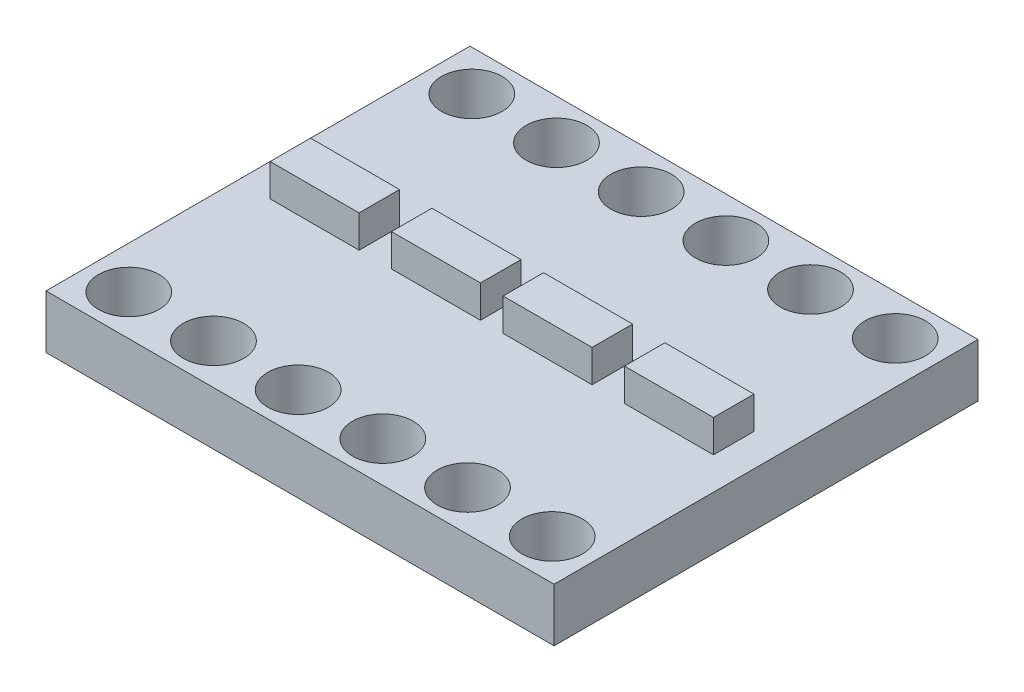
ISO-10303-21;
HEADER;
FILE_DESCRIPTION(('STEP AP214'),'2;1');
FILE_NAME('part.step','',(''),(''),'','','');
FILE_SCHEMA(('AUTOMOTIVE_DESIGN { 1 0 10303 214 1 1 1 1 }'));
ENDSEC;
DATA;
#1=APPLICATION_CONTEXT('core data for automotive mechanical design processes');
#2=APPLICATION_PROTOCOL_DEFINITION('international standard','automotive_design',2000,#1);
#3=PRODUCT_CONTEXT('',#1,'mechanical');
#4=PRODUCT('Part','Part','',(#3));
#5=PRODUCT_RELATED_PRODUCT_CATEGORY('part','',(#4));
#6=PRODUCT_DEFINITION_FORMATION('','',#4);
#7=PRODUCT_DEFINITION_CONTEXT('part definition',#1,'design');
#8=PRODUCT_DEFINITION('design','',#6,#7);
#9=PRODUCT_DEFINITION_SHAPE('','',#8);
#10=(LENGTH_UNIT() NAMED_UNIT(*) SI_UNIT(.MILLI.,.METRE.));
#11=(NAMED_UNIT(*) PLANE_ANGLE_UNIT() SI_UNIT($,.RADIAN.));
#12=(NAMED_UNIT(*) SI_UNIT($,.STERADIAN.) SOLID_ANGLE_UNIT());
#13=UNCERTAINTY_MEASURE_WITH_UNIT(LENGTH_MEASURE(1.E-05),#10,'distance_accuracy_value','');
#14=(GEOMETRIC_REPRESENTATION_CONTEXT(3) GLOBAL_UNCERTAINTY_ASSIGNED_CONTEXT((#13)) GLOBAL_UNIT_ASSIGNED_CONTEXT((#10,
#11,#12)) REPRESENTATION_CONTEXT('',''));
#15=CARTESIAN_POINT('',(0.,0.,0.));
#16=DIRECTION('',(0.,0.,1.));
#17=DIRECTION('',(1.,0.,0.));
#18=AXIS2_PLACEMENT_3D('',#15,#16,#17);
#19=CARTESIAN_POINT('',(0.,1.6764,0.));
#20=DIRECTION('',(0.,-1.,0.));
#21=DIRECTION('',(0.,0.,-1.));
#22=AXIS2_PLACEMENT_3D('',#19,#20,#21);
#23=PLANE('',#22);
#24=CARTESIAN_POINT('',(9.30489206666666,1.6764,-1.27));
#25=DIRECTION('',(0.,1.,0.));
#26=DIRECTION('',(0.,0.,-1.));
#27=AXIS2_PLACEMENT_3D('',#24,#25,#26);
#28=CIRCLE('',#27,0.952499999999998);
#29=CARTESIAN_POINT('',(9.30489206666666,1.6764,-2.2225));
#30=VERTEX_POINT('',#29);
#31=EDGE_CURVE('E873',#30,#30,#28,.T.);
#32=ORIENTED_EDGE('',*,*,#31,.F.);
#33=EDGE_LOOP('',(#32));
#34=FACE_BOUND('',#33,.T.);
#35=CARTESIAN_POINT('',(11.9634338666667,1.6764,-1.27));
#36=DIRECTION('',(0.,1.,0.));
#37=DIRECTION('',(0.,0.,-1.));
#38=AXIS2_PLACEMENT_3D('',#35,#36,#37);
#39=CIRCLE('',#38,0.952499999999998);
#40=CARTESIAN_POINT('',(11.9634338666667,1.6764,-2.2225));
#41=VERTEX_POINT('',#40);
#42=EDGE_CURVE('E877',#41,#41,#39,.T.);
#43=ORIENTED_EDGE('',*,*,#42,.F.);
#44=EDGE_LOOP('',(#43));
#45=FACE_BOUND('',#44,.T.);
#46=CARTESIAN_POINT('',(14.6219756666667,1.6764,-1.27));
#47=DIRECTION('',(0.,1.,0.));
#48=DIRECTION('',(0.,0.,-1.));
#49=AXIS2_PLACEMENT_3D('',#46,#47,#48);
#50=CIRCLE('',#49,0.952499999999998);
#51=CARTESIAN_POINT('',(14.6219756666667,1.6764,-2.2225));
#52=VERTEX_POINT('',#51);
#53=EDGE_CURVE('E947',#52,#52,#50,.T.);
#54=ORIENTED_EDGE('',*,*,#53,.F.);
#55=EDGE_LOOP('',(#54));
#56=FACE_BOUND('',#55,.T.);
#57=CARTESIAN_POINT('',(14.6219756666667,1.6764,-12.0396));
#58=DIRECTION('',(0.,1.,0.));
#59=DIRECTION('',(0.,0.,1.));
#60=AXIS2_PLACEMENT_3D('',#57,#58,#59);
#61=CIRCLE('',#60,0.952499999999998);
#62=CARTESIAN_POINT('',(14.6219756666667,1.6764,-11.0871));
#63=VERTEX_POINT('',#62);
#64=EDGE_CURVE('E908',#63,#63,#61,.T.);
#65=ORIENTED_EDGE('',*,*,#64,.F.);
#66=EDGE_LOOP('',(#65));
#67=FACE_BOUND('',#66,.T.);
#68=CARTESIAN_POINT('',(11.9634338666667,1.6764,-12.0396));
#69=DIRECTION('',(0.,1.,0.));
#70=DIRECTION('',(0.,0.,1.));
#71=AXIS2_PLACEMENT_3D('',#68,#69,#70);
#72=CIRCLE('',#71,0.952499999999998);
#73=CARTESIAN_POINT('',(11.9634338666667,1.6764,-11.0871));
#74=VERTEX_POINT('',#73);
#75=EDGE_CURVE('E902',#74,#74,#72,.T.);
#76=ORIENTED_EDGE('',*,*,#75,.F.);
#77=EDGE_LOOP('',(#76));
#78=FACE_BOUND('',#77,.T.);
#79=CARTESIAN_POINT('',(9.30489206666666,1.6764,-12.0396));
#80=DIRECTION('',(0.,1.,0.));
#81=DIRECTION('',(0.,0.,1.));
#82=AXIS2_PLACEMENT_3D('',#79,#80,#81);
#83=CIRCLE('',#82,0.952499999999998);
#84=CARTESIAN_POINT('',(9.30489206666666,1.6764,-11.0871));
#85=VERTEX_POINT('',#84);
#86=EDGE_CURVE('E896',#85,#85,#83,.T.);
#87=ORIENTED_EDGE('',*,*,#86,.F.);
#88=EDGE_LOOP('',(#87));
#89=FACE_BOUND('',#88,.T.);
#90=CARTESIAN_POINT('',(6.64635026666666,1.6764,-12.0396));
#91=DIRECTION('',(0.,1.,0.));
#92=DIRECTION('',(0.,0.,1.));
#93=AXIS2_PLACEMENT_3D('',#90,#91,#92);
#94=CIRCLE('',#93,0.952499999999999);
#95=CARTESIAN_POINT('',(6.64635026666666,1.6764,-11.0871));
#96=VERTEX_POINT('',#95);
#97=EDGE_CURVE('E890',#96,#96,#94,.T.);
#98=ORIENTED_EDGE('',*,*,#97,.F.);
#99=EDGE_LOOP('',(#98));
#100=FACE_BOUND('',#99,.T.);
#101=CARTESIAN_POINT('',(1.32926666666666,1.6764,-12.0396));
#102=DIRECTION('',(0.,1.,0.));
#103=DIRECTION('',(0.,0.,1.));
#104=AXIS2_PLACEMENT_3D('',#101,#102,#103);
#105=CIRCLE('',#104,0.952499999999999);
#106=CARTESIAN_POINT('',(1.32926666666666,1.6764,-11.0871));
#107=VERTEX_POINT('',#106);
#108=EDGE_CURVE('E883',#107,#107,#105,.T.);
#109=ORIENTED_EDGE('',*,*,#108,.F.);
#110=EDGE_LOOP('',(#109));
#111=FACE_BOUND('',#110,.T.);
#112=CARTESIAN_POINT('',(6.64635026666666,1.6764,-1.27));
#113=DIRECTION('',(0.,1.,0.));
#114=DIRECTION('',(0.,0.,-1.));
#115=AXIS2_PLACEMENT_3D('',#112,#113,#114);
#116=CIRCLE('',#115,0.952499999999999);
#117=CARTESIAN_POINT('',(6.64635026666666,1.6764,-2.2225));
#118=VERTEX_POINT('',#117);
#119=EDGE_CURVE('E879',#118,#118,#116,.T.);
#120=ORIENTED_EDGE('',*,*,#119,.F.);
#121=EDGE_LOOP('',(#120));
#122=FACE_BOUND('',#121,.T.);
#123=CARTESIAN_POINT('',(3.98780846666666,1.6764,-1.27));
#124=DIRECTION('',(0.,1.,0.));
#125=DIRECTION('',(0.,0.,-1.));
#126=AXIS2_PLACEMENT_3D('',#123,#124,#125);
#127=CIRCLE('',#126,0.952499999999998);
#128=CARTESIAN_POINT('',(3.98780846666666,1.6764,-2.2225));
#129=VERTEX_POINT('',#128);
#130=EDGE_CURVE('E978',#129,#129,#127,.T.);
#131=ORIENTED_EDGE('',*,*,#130,.F.);
#132=EDGE_LOOP('',(#131));
#133=FACE_BOUND('',#132,.T.);
#134=CARTESIAN_POINT('',(1.32926666666666,1.6764,-1.27));
#135=DIRECTION('',(0.,1.,0.));
#136=DIRECTION('',(0.,0.,-1.));
#137=AXIS2_PLACEMENT_3D('',#134,#135,#136);
#138=CIRCLE('',#137,0.952499999999999);
#139=CARTESIAN_POINT('',(1.32926666666666,1.6764,-2.2225));
#140=VERTEX_POINT('',#139);
#141=EDGE_CURVE('E981',#140,#140,#138,.T.);
#142=ORIENTED_EDGE('',*,*,#141,.F.);
#143=EDGE_LOOP('',(#142));
#144=FACE_BOUND('',#143,.T.);
#145=CARTESIAN_POINT('',(3.98780846666666,1.6764,-12.0396));
#146=DIRECTION('',(0.,1.,0.));
#147=DIRECTION('',(0.,0.,1.));
#148=AXIS2_PLACEMENT_3D('',#145,#146,#147);
#149=CIRCLE('',#148,0.952499999999998);
#150=CARTESIAN_POINT('',(3.98780846666666,1.6764,-11.0871));
#151=VERTEX_POINT('',#150);
#152=EDGE_CURVE('E886',#151,#151,#149,.T.);
#153=ORIENTED_EDGE('',*,*,#152,.F.);
#154=EDGE_LOOP('',(#153));
#155=FACE_BOUND('',#154,.T.);
#156=DIRECTION('',(0.,0.,1.));
#157=VECTOR('',#156,1.);
#158=CARTESIAN_POINT('',(8.3312,1.6764,-7.2898));
#159=LINE('',#158,#157);
#160=CARTESIAN_POINT('',(8.3312,1.6764,-7.2898));
#161=VERTEX_POINT('',#160);
#162=CARTESIAN_POINT('',(8.3312,1.6764,-6.0198));
#163=VERTEX_POINT('',#162);
#164=EDGE_CURVE('E229',#161,#163,#159,.T.);
#165=ORIENTED_EDGE('',*,*,#164,.F.);
#166=DIRECTION('',(-1.,0.,0.));
#167=VECTOR('',#166,1.);
#168=CARTESIAN_POINT('',(8.3312,1.6764,-7.2898));
#169=LINE('',#168,#167);
#170=CARTESIAN_POINT('',(11.1252,1.6764,-7.2898));
#171=VERTEX_POINT('',#170);
#172=EDGE_CURVE('E219',#171,#161,#169,.T.);
#173=ORIENTED_EDGE('',*,*,#172,.F.);
#174=DIRECTION('',(0.,0.,-1.));
#175=VECTOR('',#174,1.);
#176=CARTESIAN_POINT('',(11.1252,1.6764,-7.2898));
#177=LINE('',#176,#175);
#178=CARTESIAN_POINT('',(11.1252,1.6764,-6.0198));
#179=VERTEX_POINT('',#178);
#180=EDGE_CURVE('E222',#179,#171,#177,.T.);
#181=ORIENTED_EDGE('',*,*,#180,.F.);
#182=DIRECTION('',(1.,0.,0.));
#183=VECTOR('',#182,1.);
#184=CARTESIAN_POINT('',(8.3312,1.6764,-6.0198));
#185=LINE('',#184,#183);
#186=EDGE_CURVE('E226',#163,#179,#185,.T.);
#187=ORIENTED_EDGE('',*,*,#186,.F.);
#188=EDGE_LOOP('',(#165,#173,#181,#187));
#189=FACE_BOUND('',#188,.T.);
#190=DIRECTION('',(0.,0.,1.));
#191=VECTOR('',#190,1.);
#192=CARTESIAN_POINT('',(1.016,1.6764,-7.2898));
#193=LINE('',#192,#191);
#194=CARTESIAN_POINT('',(1.016,1.6764,-7.2898));
#195=VERTEX_POINT('',#194);
#196=CARTESIAN_POINT('',(1.016,1.6764,-6.0198));
#197=VERTEX_POINT('',#196);
#198=EDGE_CURVE('E265',#195,#197,#193,.T.);
#199=ORIENTED_EDGE('',*,*,#198,.F.);
#200=DIRECTION('',(-1.,0.,0.));
#201=VECTOR('',#200,1.);
#202=CARTESIAN_POINT('',(1.016,1.6764,-7.2898));
#203=LINE('',#202,#201);
#204=CARTESIAN_POINT('',(3.81,1.6764,-7.2898));
#205=VERTEX_POINT('',#204);
#206=EDGE_CURVE('E277',#205,#195,#203,.T.);
#207=ORIENTED_EDGE('',*,*,#206,.F.);
#208=DIRECTION('',(0.,0.,-1.));
#209=VECTOR('',#208,1.);
#210=CARTESIAN_POINT('',(3.81,1.6764,-7.2898));
#211=LINE('',#210,#209);
#212=CARTESIAN_POINT('',(3.81,1.6764,-6.0198));
#213=VERTEX_POINT('',#212);
#214=EDGE_CURVE('E289',#213,#205,#211,.T.);
#215=ORIENTED_EDGE('',*,*,#214,.F.);
#216=DIRECTION('',(1.,0.,0.));
#217=VECTOR('',#216,1.);
#218=CARTESIAN_POINT('',(1.016,1.6764,-6.0198));
#219=LINE('',#218,#217);
#220=EDGE_CURVE('E286',#197,#213,#219,.T.);
#221=ORIENTED_EDGE('',*,*,#220,.F.);
#222=EDGE_LOOP('',(#199,#207,#215,#221));
#223=FACE_BOUND('',#222,.T.);
#224=DIRECTION('',(0.,0.,1.));
#225=VECTOR('',#224,1.);
#226=CARTESIAN_POINT('',(0.,1.6764,0.));
#227=LINE('',#226,#225);
#228=CARTESIAN_POINT('',(0.,1.6764,-13.3096));
#229=VERTEX_POINT('',#228);
#230=CARTESIAN_POINT('',(0.,1.6764,0.));
#231=VERTEX_POINT('',#230);
#232=EDGE_CURVE('E306',#229,#231,#227,.T.);
#233=ORIENTED_EDGE('',*,*,#232,.T.);
#234=DIRECTION('',(1.,0.,0.));
#235=VECTOR('',#234,1.);
#236=CARTESIAN_POINT('',(0.,1.6764,0.));
#237=LINE('',#236,#235);
#238=CARTESIAN_POINT('',(15.9512,1.6764,0.));
#239=VERTEX_POINT('',#238);
#240=EDGE_CURVE('E309',#231,#239,#237,.T.);
#241=ORIENTED_EDGE('',*,*,#240,.T.);
#242=DIRECTION('',(0.,0.,-1.));
#243=VECTOR('',#242,1.);
#244=CARTESIAN_POINT('',(15.9512,1.6764,0.));
#245=LINE('',#244,#243);
#246=CARTESIAN_POINT('',(15.9512,1.6764,-13.3096));
#247=VERTEX_POINT('',#246);
#248=EDGE_CURVE('E312',#239,#247,#245,.T.);
#249=ORIENTED_EDGE('',*,*,#248,.T.);
#250=DIRECTION('',(-1.,0.,0.));
#251=VECTOR('',#250,1.);
#252=CARTESIAN_POINT('',(0.,1.6764,-13.3096));
#253=LINE('',#252,#251);
#254=EDGE_CURVE('E314',#247,#229,#253,.T.);
#255=ORIENTED_EDGE('',*,*,#254,.T.);
#256=EDGE_LOOP('',(#233,#241,#249,#255));
#257=FACE_BOUND('',#256,.T.);
#258=DIRECTION('',(0.,0.,1.));
#259=VECTOR('',#258,1.);
#260=CARTESIAN_POINT('',(4.826,1.6764,-7.2898));
#261=LINE('',#260,#259);
#262=CARTESIAN_POINT('',(4.826,1.6764,-7.2898));
#263=VERTEX_POINT('',#262);
#264=CARTESIAN_POINT('',(4.826,1.6764,-6.0198));
#265=VERTEX_POINT('',#264);
#266=EDGE_CURVE('E262',#263,#265,#261,.T.);
#267=ORIENTED_EDGE('',*,*,#266,.F.);
#268=DIRECTION('',(-1.,0.,0.));
#269=VECTOR('',#268,1.);
#270=CARTESIAN_POINT('',(4.826,1.6764,-7.2898));
#271=LINE('',#270,#269);
#272=CARTESIAN_POINT('',(7.62,1.6764,-7.2898));
#273=VERTEX_POINT('',#272);
#274=EDGE_CURVE('E252',#273,#263,#271,.T.);
#275=ORIENTED_EDGE('',*,*,#274,.F.);
#276=DIRECTION('',(0.,0.,-1.));
#277=VECTOR('',#276,1.);
#278=CARTESIAN_POINT('',(7.62,1.6764,-7.2898));
#279=LINE('',#278,#277);
#280=CARTESIAN_POINT('',(7.62,1.6764,-6.0198));
#281=VERTEX_POINT('',#280);
#282=EDGE_CURVE('E255',#281,#273,#279,.T.);
#283=ORIENTED_EDGE('',*,*,#282,.F.);
#284=DIRECTION('',(1.,0.,0.));
#285=VECTOR('',#284,1.);
#286=CARTESIAN_POINT('',(4.826,1.6764,-6.0198));
#287=LINE('',#286,#285);
#288=EDGE_CURVE('E259',#265,#281,#287,.T.);
#289=ORIENTED_EDGE('',*,*,#288,.F.);
#290=EDGE_LOOP('',(#267,#275,#283,#289));
#291=FACE_BOUND('',#290,.T.);
#292=DIRECTION('',(0.,0.,1.));
#293=VECTOR('',#292,1.);
#294=CARTESIAN_POINT('',(12.1412,1.6764,-7.2898));
#295=LINE('',#294,#293);
#296=CARTESIAN_POINT('',(12.1412,1.6764,-7.2898));
#297=VERTEX_POINT('',#296);
#298=CARTESIAN_POINT('',(12.1412,1.6764,-6.0198));
#299=VERTEX_POINT('',#298);
#300=EDGE_CURVE('E172',#297,#299,#295,.T.);
#301=ORIENTED_EDGE('',*,*,#300,.F.);
#302=DIRECTION('',(-1.,0.,0.));
#303=VECTOR('',#302,1.);
#304=CARTESIAN_POINT('',(12.1412,1.6764,-7.2898));
#305=LINE('',#304,#303);
#306=CARTESIAN_POINT('',(14.9352,1.6764,-7.2898));
#307=VERTEX_POINT('',#306);
#308=EDGE_CURVE('E174',#307,#297,#305,.T.);
#309=ORIENTED_EDGE('',*,*,#308,.F.);
#310=DIRECTION('',(0.,0.,-1.));
#311=VECTOR('',#310,1.);
#312=CARTESIAN_POINT('',(14.9352,1.6764,-7.2898));
#313=LINE('',#312,#311);
#314=CARTESIAN_POINT('',(14.9352,1.6764,-6.0198));
#315=VERTEX_POINT('',#314);
#316=EDGE_CURVE('E59',#315,#307,#313,.T.);
#317=ORIENTED_EDGE('',*,*,#316,.F.);
#318=DIRECTION('',(1.,0.,0.));
#319=VECTOR('',#318,1.);
#320=CARTESIAN_POINT('',(12.1412,1.6764,-6.0198));
#321=LINE('',#320,#319);
#322=EDGE_CURVE('E54',#299,#315,#321,.T.);
#323=ORIENTED_EDGE('',*,*,#322,.F.);
#324=EDGE_LOOP('',(#301,#309,#317,#323));
#325=FACE_BOUND('',#324,.T.);
#326=ADVANCED_FACE('F39',(#34,#45,#56,#67,#78,#89,#100,#111,#122,#133,#144,#155,#189,#223,#257,
#291,#325),#23,.F.);
#327=CARTESIAN_POINT('',(0.,1.6764,0.));
#328=DIRECTION('',(1.,0.,0.));
#329=DIRECTION('',(0.,0.,-1.));
#330=AXIS2_PLACEMENT_3D('',#327,#328,#329);
#331=PLANE('',#330);
#332=DIRECTION('',(0.,0.,1.));
#333=VECTOR('',#332,1.);
#334=CARTESIAN_POINT('',(0.,0.,0.));
#335=LINE('',#334,#333);
#336=CARTESIAN_POINT('',(0.,0.,-13.3096));
#337=VERTEX_POINT('',#336);
#338=CARTESIAN_POINT('',(0.,0.,0.));
#339=VERTEX_POINT('',#338);
#340=EDGE_CURVE('E305',#337,#339,#335,.T.);
#341=ORIENTED_EDGE('',*,*,#340,.T.);
#342=DIRECTION('',(0.,-1.,0.));
#343=VECTOR('',#342,1.);
#344=CARTESIAN_POINT('',(0.,1.6764,0.));
#345=LINE('',#344,#343);
#346=EDGE_CURVE('E11',#231,#339,#345,.T.);
#347=ORIENTED_EDGE('',*,*,#346,.F.);
#348=ORIENTED_EDGE('',*,*,#232,.F.);
#349=DIRECTION('',(0.,-1.,0.));
#350=VECTOR('',#349,1.);
#351=CARTESIAN_POINT('',(0.,1.6764,-13.3096));
#352=LINE('',#351,#350);
#353=EDGE_CURVE('E316',#229,#337,#352,.T.);
#354=ORIENTED_EDGE('',*,*,#353,.T.);
#355=EDGE_LOOP('',(#341,#347,#348,#354));
#356=FACE_BOUND('',#355,.T.);
#357=ADVANCED_FACE('F41',(#356),#331,.F.);
#358=CARTESIAN_POINT('',(0.,1.6764,0.));
#359=DIRECTION('',(0.,0.,-1.));
#360=DIRECTION('',(-1.,0.,0.));
#361=AXIS2_PLACEMENT_3D('',#358,#359,#360);
#362=PLANE('',#361);
#363=DIRECTION('',(1.,0.,0.));
#364=VECTOR('',#363,1.);
#365=CARTESIAN_POINT('',(0.,0.,0.));
#366=LINE('',#365,#364);
#367=CARTESIAN_POINT('',(15.9512,0.,0.));
#368=VERTEX_POINT('',#367);
#369=EDGE_CURVE('E319',#339,#368,#366,.T.);
#370=ORIENTED_EDGE('',*,*,#369,.T.);
#371=DIRECTION('',(0.,-1.,0.));
#372=VECTOR('',#371,1.);
#373=CARTESIAN_POINT('',(15.9512,1.6764,0.));
#374=LINE('',#373,#372);
#375=EDGE_CURVE('E47',#239,#368,#374,.T.);
#376=ORIENTED_EDGE('',*,*,#375,.F.);
#377=ORIENTED_EDGE('',*,*,#240,.F.);
#378=ORIENTED_EDGE('',*,*,#346,.T.);
#379=EDGE_LOOP('',(#370,#376,#377,#378));
#380=FACE_BOUND('',#379,.T.);
#381=ADVANCED_FACE('F349',(#380),#362,.F.);
#382=CARTESIAN_POINT('',(15.9512,1.6764,0.));
#383=DIRECTION('',(-1.,0.,0.));
#384=DIRECTION('',(0.,0.,1.));
#385=AXIS2_PLACEMENT_3D('',#382,#383,#384);
#386=PLANE('',#385);
#387=DIRECTION('',(0.,0.,-1.));
#388=VECTOR('',#387,1.);
#389=CARTESIAN_POINT('',(15.9512,0.,0.));
#390=LINE('',#389,#388);
#391=CARTESIAN_POINT('',(15.9512,0.,-13.3096));
#392=VERTEX_POINT('',#391);
#393=EDGE_CURVE('E321',#368,#392,#390,.T.);
#394=ORIENTED_EDGE('',*,*,#393,.T.);
#395=DIRECTION('',(0.,-1.,0.));
#396=VECTOR('',#395,1.);
#397=CARTESIAN_POINT('',(15.9512,1.6764,-13.3096));
#398=LINE('',#397,#396);
#399=EDGE_CURVE('E326',#247,#392,#398,.T.);
#400=ORIENTED_EDGE('',*,*,#399,.F.);
#401=ORIENTED_EDGE('',*,*,#248,.F.);
#402=ORIENTED_EDGE('',*,*,#375,.T.);
#403=EDGE_LOOP('',(#394,#400,#401,#402));
#404=FACE_BOUND('',#403,.T.);
#405=ADVANCED_FACE('F333',(#404),#386,.F.);
#406=CARTESIAN_POINT('',(0.,1.6764,-13.3096));
#407=DIRECTION('',(0.,0.,1.));
#408=DIRECTION('',(1.,0.,0.));
#409=AXIS2_PLACEMENT_3D('',#406,#407,#408);
#410=PLANE('',#409);
#411=DIRECTION('',(-1.,0.,0.));
#412=VECTOR('',#411,1.);
#413=CARTESIAN_POINT('',(0.,0.,-13.3096));
#414=LINE('',#413,#412);
#415=EDGE_CURVE('E310',#392,#337,#414,.T.);
#416=ORIENTED_EDGE('',*,*,#415,.T.);
#417=ORIENTED_EDGE('',*,*,#353,.F.);
#418=ORIENTED_EDGE('',*,*,#254,.F.);
#419=ORIENTED_EDGE('',*,*,#399,.T.);
#420=EDGE_LOOP('',(#416,#417,#418,#419));
#421=FACE_BOUND('',#420,.T.);
#422=ADVANCED_FACE('F342',(#421),#410,.F.);
#423=CARTESIAN_POINT('',(0.,0.,0.));
#424=DIRECTION('',(0.,-1.,0.));
#425=DIRECTION('',(0.,0.,-1.));
#426=AXIS2_PLACEMENT_3D('',#423,#424,#425);
#427=PLANE('',#426);
#428=CARTESIAN_POINT('',(9.30489206666666,0.,-1.27));
#429=DIRECTION('',(0.,1.,0.));
#430=DIRECTION('',(0.,0.,-1.));
#431=AXIS2_PLACEMENT_3D('',#428,#429,#430);
#432=CIRCLE('',#431,0.952499999999998);
#433=CARTESIAN_POINT('',(9.30489206666666,0.,-2.2225));
#434=VERTEX_POINT('',#433);
#435=EDGE_CURVE('E871',#434,#434,#432,.T.);
#436=ORIENTED_EDGE('',*,*,#435,.T.);
#437=EDGE_LOOP('',(#436));
#438=FACE_BOUND('',#437,.T.);
#439=CARTESIAN_POINT('',(11.9634338666667,0.,-1.27));
#440=DIRECTION('',(0.,1.,0.));
#441=DIRECTION('',(0.,0.,-1.));
#442=AXIS2_PLACEMENT_3D('',#439,#440,#441);
#443=CIRCLE('',#442,0.952499999999998);
#444=CARTESIAN_POINT('',(11.9634338666667,0.,-2.2225));
#445=VERTEX_POINT('',#444);
#446=EDGE_CURVE('E874',#445,#445,#443,.T.);
#447=ORIENTED_EDGE('',*,*,#446,.T.);
#448=EDGE_LOOP('',(#447));
#449=FACE_BOUND('',#448,.T.);
#450=CARTESIAN_POINT('',(14.6219756666667,0.,-1.27));
#451=DIRECTION('',(0.,1.,0.));
#452=DIRECTION('',(0.,0.,-1.));
#453=AXIS2_PLACEMENT_3D('',#450,#451,#452);
#454=CIRCLE('',#453,0.952499999999998);
#455=CARTESIAN_POINT('',(14.6219756666667,0.,-2.2225));
#456=VERTEX_POINT('',#455);
#457=EDGE_CURVE('E955',#456,#456,#454,.T.);
#458=ORIENTED_EDGE('',*,*,#457,.T.);
#459=EDGE_LOOP('',(#458));
#460=FACE_BOUND('',#459,.T.);
#461=CARTESIAN_POINT('',(14.6219756666667,0.,-12.0396));
#462=DIRECTION('',(0.,1.,0.));
#463=DIRECTION('',(0.,0.,1.));
#464=AXIS2_PLACEMENT_3D('',#461,#462,#463);
#465=CIRCLE('',#464,0.952499999999998);
#466=CARTESIAN_POINT('',(14.6219756666667,0.,-11.0871));
#467=VERTEX_POINT('',#466);
#468=EDGE_CURVE('E942',#467,#467,#465,.T.);
#469=ORIENTED_EDGE('',*,*,#468,.T.);
#470=EDGE_LOOP('',(#469));
#471=FACE_BOUND('',#470,.T.);
#472=CARTESIAN_POINT('',(11.9634338666667,0.,-12.0396));
#473=DIRECTION('',(0.,1.,0.));
#474=DIRECTION('',(0.,0.,1.));
#475=AXIS2_PLACEMENT_3D('',#472,#473,#474);
#476=CIRCLE('',#475,0.952499999999998);
#477=CARTESIAN_POINT('',(11.9634338666667,0.,-11.0871));
#478=VERTEX_POINT('',#477);
#479=EDGE_CURVE('E905',#478,#478,#476,.T.);
#480=ORIENTED_EDGE('',*,*,#479,.T.);
#481=EDGE_LOOP('',(#480));
#482=FACE_BOUND('',#481,.T.);
#483=CARTESIAN_POINT('',(9.30489206666666,0.,-12.0396));
#484=DIRECTION('',(0.,1.,0.));
#485=DIRECTION('',(0.,0.,1.));
#486=AXIS2_PLACEMENT_3D('',#483,#484,#485);
#487=CIRCLE('',#486,0.952499999999998);
#488=CARTESIAN_POINT('',(9.30489206666666,0.,-11.0871));
#489=VERTEX_POINT('',#488);
#490=EDGE_CURVE('E899',#489,#489,#487,.T.);
#491=ORIENTED_EDGE('',*,*,#490,.T.);
#492=EDGE_LOOP('',(#491));
#493=FACE_BOUND('',#492,.T.);
#494=CARTESIAN_POINT('',(6.64635026666666,0.,-12.0396));
#495=DIRECTION('',(0.,1.,0.));
#496=DIRECTION('',(0.,0.,1.));
#497=AXIS2_PLACEMENT_3D('',#494,#495,#496);
#498=CIRCLE('',#497,0.952499999999999);
#499=CARTESIAN_POINT('',(6.64635026666666,0.,-11.0871));
#500=VERTEX_POINT('',#499);
#501=EDGE_CURVE('E893',#500,#500,#498,.T.);
#502=ORIENTED_EDGE('',*,*,#501,.T.);
#503=EDGE_LOOP('',(#502));
#504=FACE_BOUND('',#503,.T.);
#505=CARTESIAN_POINT('',(1.32926666666666,0.,-12.0396));
#506=DIRECTION('',(0.,1.,0.));
#507=DIRECTION('',(0.,0.,1.));
#508=AXIS2_PLACEMENT_3D('',#505,#506,#507);
#509=CIRCLE('',#508,0.952499999999999);
#510=CARTESIAN_POINT('',(1.32926666666666,0.,-11.0871));
#511=VERTEX_POINT('',#510);
#512=EDGE_CURVE('E887',#511,#511,#509,.T.);
#513=ORIENTED_EDGE('',*,*,#512,.T.);
#514=EDGE_LOOP('',(#513));
#515=FACE_BOUND('',#514,.T.);
#516=CARTESIAN_POINT('',(6.64635026666666,0.,-1.27));
#517=DIRECTION('',(0.,1.,0.));
#518=DIRECTION('',(0.,0.,-1.));
#519=AXIS2_PLACEMENT_3D('',#516,#517,#518);
#520=CIRCLE('',#519,0.952499999999999);
#521=CARTESIAN_POINT('',(6.64635026666666,0.,-2.2225));
#522=VERTEX_POINT('',#521);
#523=EDGE_CURVE('E989',#522,#522,#520,.T.);
#524=ORIENTED_EDGE('',*,*,#523,.T.);
#525=EDGE_LOOP('',(#524));
#526=FACE_BOUND('',#525,.T.);
#527=CARTESIAN_POINT('',(3.98780846666666,0.,-1.27));
#528=DIRECTION('',(0.,1.,0.));
#529=DIRECTION('',(0.,0.,-1.));
#530=AXIS2_PLACEMENT_3D('',#527,#528,#529);
#531=CIRCLE('',#530,0.952499999999998);
#532=CARTESIAN_POINT('',(3.98780846666666,0.,-2.2225));
#533=VERTEX_POINT('',#532);
#534=EDGE_CURVE('E983',#533,#533,#531,.T.);
#535=ORIENTED_EDGE('',*,*,#534,.T.);
#536=EDGE_LOOP('',(#535));
#537=FACE_BOUND('',#536,.T.);
#538=CARTESIAN_POINT('',(1.32926666666666,0.,-1.27));
#539=DIRECTION('',(0.,1.,0.));
#540=DIRECTION('',(0.,0.,-1.));
#541=AXIS2_PLACEMENT_3D('',#538,#539,#540);
#542=CIRCLE('',#541,0.952499999999999);
#543=CARTESIAN_POINT('',(1.32926666666666,0.,-2.2225));
#544=VERTEX_POINT('',#543);
#545=EDGE_CURVE('E950',#544,#544,#542,.T.);
#546=ORIENTED_EDGE('',*,*,#545,.T.);
#547=EDGE_LOOP('',(#546));
#548=FACE_BOUND('',#547,.T.);
#549=CARTESIAN_POINT('',(3.98780846666666,0.,-12.0396));
#550=DIRECTION('',(0.,1.,0.));
#551=DIRECTION('',(0.,0.,1.));
#552=AXIS2_PLACEMENT_3D('',#549,#550,#551);
#553=CIRCLE('',#552,0.952499999999998);
#554=CARTESIAN_POINT('',(3.98780846666666,0.,-11.0871));
#555=VERTEX_POINT('',#554);
#556=EDGE_CURVE('E909',#555,#555,#553,.T.);
#557=ORIENTED_EDGE('',*,*,#556,.T.);
#558=EDGE_LOOP('',(#557));
#559=FACE_BOUND('',#558,.T.);
#560=ORIENTED_EDGE('',*,*,#340,.F.);
#561=ORIENTED_EDGE('',*,*,#415,.F.);
#562=ORIENTED_EDGE('',*,*,#393,.F.);
#563=ORIENTED_EDGE('',*,*,#369,.F.);
#564=EDGE_LOOP('',(#560,#561,#562,#563));
#565=FACE_BOUND('',#564,.T.);
#566=ADVANCED_FACE('F339',(#438,#449,#460,#471,#482,#493,#504,#515,#526,#537,#548,#559,#565),
#427,.T.);
#567=CARTESIAN_POINT('',(1.016,2.6924,-7.2898));
#568=DIRECTION('',(1.,0.,0.));
#569=DIRECTION('',(0.,0.,-1.));
#570=AXIS2_PLACEMENT_3D('',#567,#568,#569);
#571=PLANE('',#570);
#572=ORIENTED_EDGE('',*,*,#198,.T.);
#573=DIRECTION('',(0.,-1.,0.));
#574=VECTOR('',#573,1.);
#575=CARTESIAN_POINT('',(1.016,2.6924,-6.0198));
#576=LINE('',#575,#574);
#577=CARTESIAN_POINT('',(1.016,2.6924,-6.0198));
#578=VERTEX_POINT('',#577);
#579=EDGE_CURVE('E302',#578,#197,#576,.T.);
#580=ORIENTED_EDGE('',*,*,#579,.F.);
#581=DIRECTION('',(0.,0.,1.));
#582=VECTOR('',#581,1.);
#583=CARTESIAN_POINT('',(1.016,2.6924,-7.2898));
#584=LINE('',#583,#582);
#585=CARTESIAN_POINT('',(1.016,2.6924,-7.2898));
#586=VERTEX_POINT('',#585);
#587=EDGE_CURVE('E273',#586,#578,#584,.T.);
#588=ORIENTED_EDGE('',*,*,#587,.F.);
#589=DIRECTION('',(0.,-1.,0.));
#590=VECTOR('',#589,1.);
#591=CARTESIAN_POINT('',(1.016,2.6924,-7.2898));
#592=LINE('',#591,#590);
#593=EDGE_CURVE('E283',#586,#195,#592,.T.);
#594=ORIENTED_EDGE('',*,*,#593,.T.);
#595=EDGE_LOOP('',(#572,#580,#588,#594));
#596=FACE_BOUND('',#595,.T.);
#597=ADVANCED_FACE('F365',(#596),#571,.F.);
#598=CARTESIAN_POINT('',(1.016,2.6924,-6.0198));
#599=DIRECTION('',(0.,0.,-1.));
#600=DIRECTION('',(-1.,0.,0.));
#601=AXIS2_PLACEMENT_3D('',#598,#599,#600);
#602=PLANE('',#601);
#603=ORIENTED_EDGE('',*,*,#220,.T.);
#604=DIRECTION('',(0.,-1.,0.));
#605=VECTOR('',#604,1.);
#606=CARTESIAN_POINT('',(3.81,2.6924,-6.0198));
#607=LINE('',#606,#605);
#608=CARTESIAN_POINT('',(3.81,2.6924,-6.0198));
#609=VERTEX_POINT('',#608);
#610=EDGE_CURVE('E299',#609,#213,#607,.T.);
#611=ORIENTED_EDGE('',*,*,#610,.F.);
#612=DIRECTION('',(1.,0.,0.));
#613=VECTOR('',#612,1.);
#614=CARTESIAN_POINT('',(1.016,2.6924,-6.0198));
#615=LINE('',#614,#613);
#616=EDGE_CURVE('E276',#578,#609,#615,.T.);
#617=ORIENTED_EDGE('',*,*,#616,.F.);
#618=ORIENTED_EDGE('',*,*,#579,.T.);
#619=EDGE_LOOP('',(#603,#611,#617,#618));
#620=FACE_BOUND('',#619,.T.);
#621=ADVANCED_FACE('F387',(#620),#602,.F.);
#622=CARTESIAN_POINT('',(3.81,2.6924,-7.2898));
#623=DIRECTION('',(-1.,0.,0.));
#624=DIRECTION('',(0.,0.,1.));
#625=AXIS2_PLACEMENT_3D('',#622,#623,#624);
#626=PLANE('',#625);
#627=ORIENTED_EDGE('',*,*,#214,.T.);
#628=DIRECTION('',(0.,-1.,0.));
#629=VECTOR('',#628,1.);
#630=CARTESIAN_POINT('',(3.81,2.6924,-7.2898));
#631=LINE('',#630,#629);
#632=CARTESIAN_POINT('',(3.81,2.6924,-7.2898));
#633=VERTEX_POINT('',#632);
#634=EDGE_CURVE('E296',#633,#205,#631,.T.);
#635=ORIENTED_EDGE('',*,*,#634,.F.);
#636=DIRECTION('',(0.,0.,-1.));
#637=VECTOR('',#636,1.);
#638=CARTESIAN_POINT('',(3.81,2.6924,-7.2898));
#639=LINE('',#638,#637);
#640=EDGE_CURVE('E279',#609,#633,#639,.T.);
#641=ORIENTED_EDGE('',*,*,#640,.F.);
#642=ORIENTED_EDGE('',*,*,#610,.T.);
#643=EDGE_LOOP('',(#627,#635,#641,#642));
#644=FACE_BOUND('',#643,.T.);
#645=ADVANCED_FACE('F395',(#644),#626,.F.);
#646=CARTESIAN_POINT('',(1.016,2.6924,-7.2898));
#647=DIRECTION('',(0.,0.,1.));
#648=DIRECTION('',(1.,0.,0.));
#649=AXIS2_PLACEMENT_3D('',#646,#647,#648);
#650=PLANE('',#649);
#651=ORIENTED_EDGE('',*,*,#206,.T.);
#652=ORIENTED_EDGE('',*,*,#593,.F.);
#653=DIRECTION('',(-1.,0.,0.));
#654=VECTOR('',#653,1.);
#655=CARTESIAN_POINT('',(1.016,2.6924,-7.2898));
#656=LINE('',#655,#654);
#657=EDGE_CURVE('E281',#633,#586,#656,.T.);
#658=ORIENTED_EDGE('',*,*,#657,.F.);
#659=ORIENTED_EDGE('',*,*,#634,.T.);
#660=EDGE_LOOP('',(#651,#652,#658,#659));
#661=FACE_BOUND('',#660,.T.);
#662=ADVANCED_FACE('F402',(#661),#650,.F.);
#663=CARTESIAN_POINT('',(0.,2.6924,0.));
#664=DIRECTION('',(0.,1.,0.));
#665=DIRECTION('',(0.,0.,1.));
#666=AXIS2_PLACEMENT_3D('',#663,#664,#665);
#667=PLANE('',#666);
#668=ORIENTED_EDGE('',*,*,#587,.T.);
#669=ORIENTED_EDGE('',*,*,#616,.T.);
#670=ORIENTED_EDGE('',*,*,#640,.T.);
#671=ORIENTED_EDGE('',*,*,#657,.T.);
#672=EDGE_LOOP('',(#668,#669,#670,#671));
#673=FACE_BOUND('',#672,.T.);
#674=ADVANCED_FACE('F411',(#673),#667,.T.);
#675=CARTESIAN_POINT('',(4.826,2.6924,-7.2898));
#676=DIRECTION('',(1.,0.,0.));
#677=DIRECTION('',(0.,0.,-1.));
#678=AXIS2_PLACEMENT_3D('',#675,#676,#677);
#679=PLANE('',#678);
#680=ORIENTED_EDGE('',*,*,#266,.T.);
#681=DIRECTION('',(0.,-1.,0.));
#682=VECTOR('',#681,1.);
#683=CARTESIAN_POINT('',(4.826,2.6924,-6.0198));
#684=LINE('',#683,#682);
#685=CARTESIAN_POINT('',(4.826,2.6924,-6.0198));
#686=VERTEX_POINT('',#685);
#687=EDGE_CURVE('E232',#686,#265,#684,.T.);
#688=ORIENTED_EDGE('',*,*,#687,.F.);
#689=DIRECTION('',(0.,0.,1.));
#690=VECTOR('',#689,1.);
#691=CARTESIAN_POINT('',(4.826,2.6924,-7.2898));
#692=LINE('',#691,#690);
#693=CARTESIAN_POINT('',(4.826,2.6924,-7.2898));
#694=VERTEX_POINT('',#693);
#695=EDGE_CURVE('E256',#694,#686,#692,.T.);
#696=ORIENTED_EDGE('',*,*,#695,.F.);
#697=DIRECTION('',(0.,-1.,0.));
#698=VECTOR('',#697,1.);
#699=CARTESIAN_POINT('',(4.826,2.6924,-7.2898));
#700=LINE('',#699,#698);
#701=EDGE_CURVE('E248',#694,#263,#700,.T.);
#702=ORIENTED_EDGE('',*,*,#701,.T.);
#703=EDGE_LOOP('',(#680,#688,#696,#702));
#704=FACE_BOUND('',#703,.T.);
#705=ADVANCED_FACE('F419',(#704),#679,.F.);
#706=CARTESIAN_POINT('',(4.826,2.6924,-6.0198));
#707=DIRECTION('',(0.,0.,-1.));
#708=DIRECTION('',(-1.,0.,0.));
#709=AXIS2_PLACEMENT_3D('',#706,#707,#708);
#710=PLANE('',#709);
#711=ORIENTED_EDGE('',*,*,#288,.T.);
#712=DIRECTION('',(0.,-1.,0.));
#713=VECTOR('',#712,1.);
#714=CARTESIAN_POINT('',(7.62,2.6924,-6.0198));
#715=LINE('',#714,#713);
#716=CARTESIAN_POINT('',(7.62,2.6924,-6.0198));
#717=VERTEX_POINT('',#716);
#718=EDGE_CURVE('E242',#717,#281,#715,.T.);
#719=ORIENTED_EDGE('',*,*,#718,.F.);
#720=DIRECTION('',(1.,0.,0.));
#721=VECTOR('',#720,1.);
#722=CARTESIAN_POINT('',(4.826,2.6924,-6.0198));
#723=LINE('',#722,#721);
#724=EDGE_CURVE('E269',#686,#717,#723,.T.);
#725=ORIENTED_EDGE('',*,*,#724,.F.);
#726=ORIENTED_EDGE('',*,*,#687,.T.);
#727=EDGE_LOOP('',(#711,#719,#725,#726));
#728=FACE_BOUND('',#727,.T.);
#729=ADVANCED_FACE('F426',(#728),#710,.F.);
#730=CARTESIAN_POINT('',(7.62,2.6924,-7.2898));
#731=DIRECTION('',(-1.,0.,0.));
#732=DIRECTION('',(0.,0.,1.));
#733=AXIS2_PLACEMENT_3D('',#730,#731,#732);
#734=PLANE('',#733);
#735=ORIENTED_EDGE('',*,*,#282,.T.);
#736=DIRECTION('',(0.,-1.,0.));
#737=VECTOR('',#736,1.);
#738=CARTESIAN_POINT('',(7.62,2.6924,-7.2898));
#739=LINE('',#738,#737);
#740=CARTESIAN_POINT('',(7.62,2.6924,-7.2898));
#741=VERTEX_POINT('',#740);
#742=EDGE_CURVE('E245',#741,#273,#739,.T.);
#743=ORIENTED_EDGE('',*,*,#742,.F.);
#744=DIRECTION('',(0.,0.,-1.));
#745=VECTOR('',#744,1.);
#746=CARTESIAN_POINT('',(7.62,2.6924,-7.2898));
#747=LINE('',#746,#745);
#748=EDGE_CURVE('E267',#717,#741,#747,.T.);
#749=ORIENTED_EDGE('',*,*,#748,.F.);
#750=ORIENTED_EDGE('',*,*,#718,.T.);
#751=EDGE_LOOP('',(#735,#743,#749,#750));
#752=FACE_BOUND('',#751,.T.);
#753=ADVANCED_FACE('F434',(#752),#734,.F.);
#754=CARTESIAN_POINT('',(4.826,2.6924,-7.2898));
#755=DIRECTION('',(0.,0.,1.));
#756=DIRECTION('',(1.,0.,0.));
#757=AXIS2_PLACEMENT_3D('',#754,#755,#756);
#758=PLANE('',#757);
#759=ORIENTED_EDGE('',*,*,#274,.T.);
#760=ORIENTED_EDGE('',*,*,#701,.F.);
#761=DIRECTION('',(-1.,0.,0.));
#762=VECTOR('',#761,1.);
#763=CARTESIAN_POINT('',(4.826,2.6924,-7.2898));
#764=LINE('',#763,#762);
#765=EDGE_CURVE('E251',#741,#694,#764,.T.);
#766=ORIENTED_EDGE('',*,*,#765,.F.);
#767=ORIENTED_EDGE('',*,*,#742,.T.);
#768=EDGE_LOOP('',(#759,#760,#766,#767));
#769=FACE_BOUND('',#768,.T.);
#770=ADVANCED_FACE('F442',(#769),#758,.F.);
#771=CARTESIAN_POINT('',(0.,2.6924,0.));
#772=DIRECTION('',(0.,1.,0.));
#773=DIRECTION('',(0.,0.,1.));
#774=AXIS2_PLACEMENT_3D('',#771,#772,#773);
#775=PLANE('',#774);
#776=ORIENTED_EDGE('',*,*,#695,.T.);
#777=ORIENTED_EDGE('',*,*,#724,.T.);
#778=ORIENTED_EDGE('',*,*,#748,.T.);
#779=ORIENTED_EDGE('',*,*,#765,.T.);
#780=EDGE_LOOP('',(#776,#777,#778,#779));
#781=FACE_BOUND('',#780,.T.);
#782=ADVANCED_FACE('F451',(#781),#775,.T.);
#783=CARTESIAN_POINT('',(8.3312,2.6924,-7.2898));
#784=DIRECTION('',(1.,0.,0.));
#785=DIRECTION('',(0.,0.,-1.));
#786=AXIS2_PLACEMENT_3D('',#783,#784,#785);
#787=PLANE('',#786);
#788=ORIENTED_EDGE('',*,*,#164,.T.);
#789=DIRECTION('',(0.,-1.,0.));
#790=VECTOR('',#789,1.);
#791=CARTESIAN_POINT('',(8.3312,2.6924,-6.0198));
#792=LINE('',#791,#790);
#793=CARTESIAN_POINT('',(8.3312,2.6924,-6.0198));
#794=VERTEX_POINT('',#793);
#795=EDGE_CURVE('E178',#794,#163,#792,.T.);
#796=ORIENTED_EDGE('',*,*,#795,.F.);
#797=DIRECTION('',(0.,0.,1.));
#798=VECTOR('',#797,1.);
#799=CARTESIAN_POINT('',(8.3312,2.6924,-7.2898));
#800=LINE('',#799,#798);
#801=CARTESIAN_POINT('',(8.3312,2.6924,-7.2898));
#802=VERTEX_POINT('',#801);
#803=EDGE_CURVE('E223',#802,#794,#800,.T.);
#804=ORIENTED_EDGE('',*,*,#803,.F.);
#805=DIRECTION('',(0.,-1.,0.));
#806=VECTOR('',#805,1.);
#807=CARTESIAN_POINT('',(8.3312,2.6924,-7.2898));
#808=LINE('',#807,#806);
#809=EDGE_CURVE('E215',#802,#161,#808,.T.);
#810=ORIENTED_EDGE('',*,*,#809,.T.);
#811=EDGE_LOOP('',(#788,#796,#804,#810));
#812=FACE_BOUND('',#811,.T.);
#813=ADVANCED_FACE('F459',(#812),#787,.F.);
#814=CARTESIAN_POINT('',(8.3312,2.6924,-6.0198));
#815=DIRECTION('',(0.,0.,-1.));
#816=DIRECTION('',(-1.,0.,0.));
#817=AXIS2_PLACEMENT_3D('',#814,#815,#816);
#818=PLANE('',#817);
#819=ORIENTED_EDGE('',*,*,#186,.T.);
#820=DIRECTION('',(0.,-1.,0.));
#821=VECTOR('',#820,1.);
#822=CARTESIAN_POINT('',(11.1252,2.6924,-6.0198));
#823=LINE('',#822,#821);
#824=CARTESIAN_POINT('',(11.1252,2.6924,-6.0198));
#825=VERTEX_POINT('',#824);
#826=EDGE_CURVE('E209',#825,#179,#823,.T.);
#827=ORIENTED_EDGE('',*,*,#826,.F.);
#828=DIRECTION('',(1.,0.,0.));
#829=VECTOR('',#828,1.);
#830=CARTESIAN_POINT('',(8.3312,2.6924,-6.0198));
#831=LINE('',#830,#829);
#832=EDGE_CURVE('E236',#794,#825,#831,.T.);
#833=ORIENTED_EDGE('',*,*,#832,.F.);
#834=ORIENTED_EDGE('',*,*,#795,.T.);
#835=EDGE_LOOP('',(#819,#827,#833,#834));
#836=FACE_BOUND('',#835,.T.);
#837=ADVANCED_FACE('F466',(#836),#818,.F.);
#838=CARTESIAN_POINT('',(11.1252,2.6924,-7.2898));
#839=DIRECTION('',(-1.,0.,0.));
#840=DIRECTION('',(0.,0.,1.));
#841=AXIS2_PLACEMENT_3D('',#838,#839,#840);
#842=PLANE('',#841);
#843=ORIENTED_EDGE('',*,*,#180,.T.);
#844=DIRECTION('',(0.,-1.,0.));
#845=VECTOR('',#844,1.);
#846=CARTESIAN_POINT('',(11.1252,2.6924,-7.2898));
#847=LINE('',#846,#845);
#848=CARTESIAN_POINT('',(11.1252,2.6924,-7.2898));
#849=VERTEX_POINT('',#848);
#850=EDGE_CURVE('E212',#849,#171,#847,.T.);
#851=ORIENTED_EDGE('',*,*,#850,.F.);
#852=DIRECTION('',(0.,0.,-1.));
#853=VECTOR('',#852,1.);
#854=CARTESIAN_POINT('',(11.1252,2.6924,-7.2898));
#855=LINE('',#854,#853);
#856=EDGE_CURVE('E234',#825,#849,#855,.T.);
#857=ORIENTED_EDGE('',*,*,#856,.F.);
#858=ORIENTED_EDGE('',*,*,#826,.T.);
#859=EDGE_LOOP('',(#843,#851,#857,#858));
#860=FACE_BOUND('',#859,.T.);
#861=ADVANCED_FACE('F474',(#860),#842,.F.);
#862=CARTESIAN_POINT('',(8.3312,2.6924,-7.2898));
#863=DIRECTION('',(0.,0.,1.));
#864=DIRECTION('',(1.,0.,0.));
#865=AXIS2_PLACEMENT_3D('',#862,#863,#864);
#866=PLANE('',#865);
#867=ORIENTED_EDGE('',*,*,#172,.T.);
#868=ORIENTED_EDGE('',*,*,#809,.F.);
#869=DIRECTION('',(-1.,0.,0.));
#870=VECTOR('',#869,1.);
#871=CARTESIAN_POINT('',(8.3312,2.6924,-7.2898));
#872=LINE('',#871,#870);
#873=EDGE_CURVE('E218',#849,#802,#872,.T.);
#874=ORIENTED_EDGE('',*,*,#873,.F.);
#875=ORIENTED_EDGE('',*,*,#850,.T.);
#876=EDGE_LOOP('',(#867,#868,#874,#875));
#877=FACE_BOUND('',#876,.T.);
#878=ADVANCED_FACE('F482',(#877),#866,.F.);
#879=CARTESIAN_POINT('',(0.,2.6924,0.));
#880=DIRECTION('',(0.,1.,0.));
#881=DIRECTION('',(0.,0.,1.));
#882=AXIS2_PLACEMENT_3D('',#879,#880,#881);
#883=PLANE('',#882);
#884=ORIENTED_EDGE('',*,*,#803,.T.);
#885=ORIENTED_EDGE('',*,*,#832,.T.);
#886=ORIENTED_EDGE('',*,*,#856,.T.);
#887=ORIENTED_EDGE('',*,*,#873,.T.);
#888=EDGE_LOOP('',(#884,#885,#886,#887));
#889=FACE_BOUND('',#888,.T.);
#890=ADVANCED_FACE('F491',(#889),#883,.T.);
#891=CARTESIAN_POINT('',(12.1412,2.6924,-7.2898));
#892=DIRECTION('',(1.,0.,0.));
#893=DIRECTION('',(0.,0.,-1.));
#894=AXIS2_PLACEMENT_3D('',#891,#892,#893);
#895=PLANE('',#894);
#896=ORIENTED_EDGE('',*,*,#300,.T.);
#897=DIRECTION('',(0.,-1.,0.));
#898=VECTOR('',#897,1.);
#899=CARTESIAN_POINT('',(12.1412,2.6924,-6.0198));
#900=LINE('',#899,#898);
#901=CARTESIAN_POINT('',(12.1412,2.6924,-6.0198));
#902=VERTEX_POINT('',#901);
#903=EDGE_CURVE('E912',#902,#299,#900,.T.);
#904=ORIENTED_EDGE('',*,*,#903,.F.);
#905=DIRECTION('',(0.,0.,1.));
#906=VECTOR('',#905,1.);
#907=CARTESIAN_POINT('',(12.1412,2.6924,-7.2898));
#908=LINE('',#907,#906);
#909=CARTESIAN_POINT('',(12.1412,2.6924,-7.2898));
#910=VERTEX_POINT('',#909);
#911=EDGE_CURVE('E189',#910,#902,#908,.T.);
#912=ORIENTED_EDGE('',*,*,#911,.F.);
#913=DIRECTION('',(0.,-1.,0.));
#914=VECTOR('',#913,1.);
#915=CARTESIAN_POINT('',(12.1412,2.6924,-7.2898));
#916=LINE('',#915,#914);
#917=EDGE_CURVE('E185',#910,#297,#916,.T.);
#918=ORIENTED_EDGE('',*,*,#917,.T.);
#919=EDGE_LOOP('',(#896,#904,#912,#918));
#920=FACE_BOUND('',#919,.T.);
#921=ADVANCED_FACE('F191',(#920),#895,.F.);
#922=CARTESIAN_POINT('',(12.1412,2.6924,-6.0198));
#923=DIRECTION('',(0.,0.,-1.));
#924=DIRECTION('',(-1.,0.,0.));
#925=AXIS2_PLACEMENT_3D('',#922,#923,#924);
#926=PLANE('',#925);
#927=ORIENTED_EDGE('',*,*,#322,.T.);
#928=DIRECTION('',(0.,-1.,0.));
#929=VECTOR('',#928,1.);
#930=CARTESIAN_POINT('',(14.9352,2.6924,-6.0198));
#931=LINE('',#930,#929);
#932=CARTESIAN_POINT('',(14.9352,2.6924,-6.0198));
#933=VERTEX_POINT('',#932);
#934=EDGE_CURVE('E197',#933,#315,#931,.T.);
#935=ORIENTED_EDGE('',*,*,#934,.F.);
#936=DIRECTION('',(1.,0.,0.));
#937=VECTOR('',#936,1.);
#938=CARTESIAN_POINT('',(12.1412,2.6924,-6.0198));
#939=LINE('',#938,#937);
#940=EDGE_CURVE('E204',#902,#933,#939,.T.);
#941=ORIENTED_EDGE('',*,*,#940,.F.);
#942=ORIENTED_EDGE('',*,*,#903,.T.);
#943=EDGE_LOOP('',(#927,#935,#941,#942));
#944=FACE_BOUND('',#943,.T.);
#945=ADVANCED_FACE('F505',(#944),#926,.F.);
#946=CARTESIAN_POINT('',(14.9352,2.6924,-7.2898));
#947=DIRECTION('',(-1.,0.,0.));
#948=DIRECTION('',(0.,0.,1.));
#949=AXIS2_PLACEMENT_3D('',#946,#947,#948);
#950=PLANE('',#949);
#951=ORIENTED_EDGE('',*,*,#316,.T.);
#952=DIRECTION('',(0.,-1.,0.));
#953=VECTOR('',#952,1.);
#954=CARTESIAN_POINT('',(14.9352,2.6924,-7.2898));
#955=LINE('',#954,#953);
#956=CARTESIAN_POINT('',(14.9352,2.6924,-7.2898));
#957=VERTEX_POINT('',#956);
#958=EDGE_CURVE('E188',#957,#307,#955,.T.);
#959=ORIENTED_EDGE('',*,*,#958,.F.);
#960=DIRECTION('',(0.,0.,-1.));
#961=VECTOR('',#960,1.);
#962=CARTESIAN_POINT('',(14.9352,2.6924,-7.2898));
#963=LINE('',#962,#961);
#964=EDGE_CURVE('E195',#933,#957,#963,.T.);
#965=ORIENTED_EDGE('',*,*,#964,.F.);
#966=ORIENTED_EDGE('',*,*,#934,.T.);
#967=EDGE_LOOP('',(#951,#959,#965,#966));
#968=FACE_BOUND('',#967,.T.);
#969=ADVANCED_FACE('F512',(#968),#950,.F.);
#970=CARTESIAN_POINT('',(12.1412,2.6924,-7.2898));
#971=DIRECTION('',(0.,0.,1.));
#972=DIRECTION('',(1.,0.,0.));
#973=AXIS2_PLACEMENT_3D('',#970,#971,#972);
#974=PLANE('',#973);
#975=ORIENTED_EDGE('',*,*,#308,.T.);
#976=ORIENTED_EDGE('',*,*,#917,.F.);
#977=DIRECTION('',(-1.,0.,0.));
#978=VECTOR('',#977,1.);
#979=CARTESIAN_POINT('',(12.1412,2.6924,-7.2898));
#980=LINE('',#979,#978);
#981=EDGE_CURVE('E193',#957,#910,#980,.T.);
#982=ORIENTED_EDGE('',*,*,#981,.F.);
#983=ORIENTED_EDGE('',*,*,#958,.T.);
#984=EDGE_LOOP('',(#975,#976,#982,#983));
#985=FACE_BOUND('',#984,.T.);
#986=ADVANCED_FACE('F183',(#985),#974,.F.);
#987=CARTESIAN_POINT('',(0.,2.6924,0.));
#988=DIRECTION('',(0.,1.,0.));
#989=DIRECTION('',(0.,0.,1.));
#990=AXIS2_PLACEMENT_3D('',#987,#988,#989);
#991=PLANE('',#990);
#992=ORIENTED_EDGE('',*,*,#911,.T.);
#993=ORIENTED_EDGE('',*,*,#940,.T.);
#994=ORIENTED_EDGE('',*,*,#964,.T.);
#995=ORIENTED_EDGE('',*,*,#981,.T.);
#996=EDGE_LOOP('',(#992,#993,#994,#995));
#997=FACE_BOUND('',#996,.T.);
#998=ADVANCED_FACE('F526',(#997),#991,.T.);
#999=CARTESIAN_POINT('',(3.98780846666666,0.,-12.0396));
#1000=DIRECTION('',(0.,1.,0.));
#1001=DIRECTION('',(0.,0.,1.));
#1002=AXIS2_PLACEMENT_3D('',#999,#1000,#1001);
#1003=CYLINDRICAL_SURFACE('',#1002,0.952499999999998);
#1004=ORIENTED_EDGE('',*,*,#556,.F.);
#1005=EDGE_LOOP('',(#1004));
#1006=FACE_BOUND('',#1005,.T.);
#1007=ORIENTED_EDGE('',*,*,#152,.T.);
#1008=EDGE_LOOP('',(#1007));
#1009=FACE_BOUND('',#1008,.T.);
#1010=ADVANCED_FACE('F532',(#1006,#1009),#1003,.F.);
#1011=CARTESIAN_POINT('',(1.32926666666666,0.,-1.27));
#1012=DIRECTION('',(0.,1.,0.));
#1013=DIRECTION('',(0.,0.,1.));
#1014=AXIS2_PLACEMENT_3D('',#1011,#1012,#1013);
#1015=CYLINDRICAL_SURFACE('',#1014,0.952499999999999);
#1016=ORIENTED_EDGE('',*,*,#545,.F.);
#1017=EDGE_LOOP('',(#1016));
#1018=FACE_BOUND('',#1017,.T.);
#1019=ORIENTED_EDGE('',*,*,#141,.T.);
#1020=EDGE_LOOP('',(#1019));
#1021=FACE_BOUND('',#1020,.T.);
#1022=ADVANCED_FACE('F540',(#1018,#1021),#1015,.F.);
#1023=CARTESIAN_POINT('',(3.98780846666666,0.,-1.27));
#1024=DIRECTION('',(0.,1.,0.));
#1025=DIRECTION('',(0.,0.,1.));
#1026=AXIS2_PLACEMENT_3D('',#1023,#1024,#1025);
#1027=CYLINDRICAL_SURFACE('',#1026,0.952499999999998);
#1028=ORIENTED_EDGE('',*,*,#534,.F.);
#1029=EDGE_LOOP('',(#1028));
#1030=FACE_BOUND('',#1029,.T.);
#1031=ORIENTED_EDGE('',*,*,#130,.T.);
#1032=EDGE_LOOP('',(#1031));
#1033=FACE_BOUND('',#1032,.T.);
#1034=ADVANCED_FACE('F550',(#1030,#1033),#1027,.F.);
#1035=CARTESIAN_POINT('',(6.64635026666666,0.,-1.27));
#1036=DIRECTION('',(0.,1.,0.));
#1037=DIRECTION('',(0.,0.,1.));
#1038=AXIS2_PLACEMENT_3D('',#1035,#1036,#1037);
#1039=CYLINDRICAL_SURFACE('',#1038,0.952499999999999);
#1040=ORIENTED_EDGE('',*,*,#523,.F.);
#1041=EDGE_LOOP('',(#1040));
#1042=FACE_BOUND('',#1041,.T.);
#1043=ORIENTED_EDGE('',*,*,#119,.T.);
#1044=EDGE_LOOP('',(#1043));
#1045=FACE_BOUND('',#1044,.T.);
#1046=ADVANCED_FACE('F558',(#1042,#1045),#1039,.F.);
#1047=CARTESIAN_POINT('',(1.32926666666666,0.,-12.0396));
#1048=DIRECTION('',(0.,1.,0.));
#1049=DIRECTION('',(0.,0.,1.));
#1050=AXIS2_PLACEMENT_3D('',#1047,#1048,#1049);
#1051=CYLINDRICAL_SURFACE('',#1050,0.952499999999999);
#1052=ORIENTED_EDGE('',*,*,#512,.F.);
#1053=EDGE_LOOP('',(#1052));
#1054=FACE_BOUND('',#1053,.T.);
#1055=ORIENTED_EDGE('',*,*,#108,.T.);
#1056=EDGE_LOOP('',(#1055));
#1057=FACE_BOUND('',#1056,.T.);
#1058=ADVANCED_FACE('F566',(#1054,#1057),#1051,.F.);
#1059=CARTESIAN_POINT('',(6.64635026666666,0.,-12.0396));
#1060=DIRECTION('',(0.,1.,0.));
#1061=DIRECTION('',(0.,0.,1.));
#1062=AXIS2_PLACEMENT_3D('',#1059,#1060,#1061);
#1063=CYLINDRICAL_SURFACE('',#1062,0.952499999999999);
#1064=ORIENTED_EDGE('',*,*,#501,.F.);
#1065=EDGE_LOOP('',(#1064));
#1066=FACE_BOUND('',#1065,.T.);
#1067=ORIENTED_EDGE('',*,*,#97,.T.);
#1068=EDGE_LOOP('',(#1067));
#1069=FACE_BOUND('',#1068,.T.);
#1070=ADVANCED_FACE('F574',(#1066,#1069),#1063,.F.);
#1071=CARTESIAN_POINT('',(9.30489206666666,0.,-12.0396));
#1072=DIRECTION('',(0.,1.,0.));
#1073=DIRECTION('',(0.,0.,1.));
#1074=AXIS2_PLACEMENT_3D('',#1071,#1072,#1073);
#1075=CYLINDRICAL_SURFACE('',#1074,0.952499999999998);
#1076=ORIENTED_EDGE('',*,*,#490,.F.);
#1077=EDGE_LOOP('',(#1076));
#1078=FACE_BOUND('',#1077,.T.);
#1079=ORIENTED_EDGE('',*,*,#86,.T.);
#1080=EDGE_LOOP('',(#1079));
#1081=FACE_BOUND('',#1080,.T.);
#1082=ADVANCED_FACE('F582',(#1078,#1081),#1075,.F.);
#1083=CARTESIAN_POINT('',(11.9634338666667,0.,-12.0396));
#1084=DIRECTION('',(0.,1.,0.));
#1085=DIRECTION('',(0.,0.,1.));
#1086=AXIS2_PLACEMENT_3D('',#1083,#1084,#1085);
#1087=CYLINDRICAL_SURFACE('',#1086,0.952499999999998);
#1088=ORIENTED_EDGE('',*,*,#479,.F.);
#1089=EDGE_LOOP('',(#1088));
#1090=FACE_BOUND('',#1089,.T.);
#1091=ORIENTED_EDGE('',*,*,#75,.T.);
#1092=EDGE_LOOP('',(#1091));
#1093=FACE_BOUND('',#1092,.T.);
#1094=ADVANCED_FACE('F590',(#1090,#1093),#1087,.F.);
#1095=CARTESIAN_POINT('',(14.6219756666667,0.,-12.0396));
#1096=DIRECTION('',(0.,1.,0.));
#1097=DIRECTION('',(0.,0.,1.));
#1098=AXIS2_PLACEMENT_3D('',#1095,#1096,#1097);
#1099=CYLINDRICAL_SURFACE('',#1098,0.952499999999998);
#1100=ORIENTED_EDGE('',*,*,#468,.F.);
#1101=EDGE_LOOP('',(#1100));
#1102=FACE_BOUND('',#1101,.T.);
#1103=ORIENTED_EDGE('',*,*,#64,.T.);
#1104=EDGE_LOOP('',(#1103));
#1105=FACE_BOUND('',#1104,.T.);
#1106=ADVANCED_FACE('F598',(#1102,#1105),#1099,.F.);
#1107=CARTESIAN_POINT('',(14.6219756666667,0.,-1.27));
#1108=DIRECTION('',(0.,1.,0.));
#1109=DIRECTION('',(0.,0.,1.));
#1110=AXIS2_PLACEMENT_3D('',#1107,#1108,#1109);
#1111=CYLINDRICAL_SURFACE('',#1110,0.952499999999998);
#1112=ORIENTED_EDGE('',*,*,#457,.F.);
#1113=EDGE_LOOP('',(#1112));
#1114=FACE_BOUND('',#1113,.T.);
#1115=ORIENTED_EDGE('',*,*,#53,.T.);
#1116=EDGE_LOOP('',(#1115));
#1117=FACE_BOUND('',#1116,.T.);
#1118=ADVANCED_FACE('F606',(#1114,#1117),#1111,.F.);
#1119=CARTESIAN_POINT('',(11.9634338666667,0.,-1.27));
#1120=DIRECTION('',(0.,1.,0.));
#1121=DIRECTION('',(0.,0.,1.));
#1122=AXIS2_PLACEMENT_3D('',#1119,#1120,#1121);
#1123=CYLINDRICAL_SURFACE('',#1122,0.952499999999998);
#1124=ORIENTED_EDGE('',*,*,#446,.F.);
#1125=EDGE_LOOP('',(#1124));
#1126=FACE_BOUND('',#1125,.T.);
#1127=ORIENTED_EDGE('',*,*,#42,.T.);
#1128=EDGE_LOOP('',(#1127));
#1129=FACE_BOUND('',#1128,.T.);
#1130=ADVANCED_FACE('F613',(#1126,#1129),#1123,.F.);
#1131=CARTESIAN_POINT('',(9.30489206666666,0.,-1.27));
#1132=DIRECTION('',(0.,1.,0.));
#1133=DIRECTION('',(0.,0.,1.));
#1134=AXIS2_PLACEMENT_3D('',#1131,#1132,#1133);
#1135=CYLINDRICAL_SURFACE('',#1134,0.952499999999998);
#1136=ORIENTED_EDGE('',*,*,#435,.F.);
#1137=EDGE_LOOP('',(#1136));
#1138=FACE_BOUND('',#1137,.T.);
#1139=ORIENTED_EDGE('',*,*,#31,.T.);
#1140=EDGE_LOOP('',(#1139));
#1141=FACE_BOUND('',#1140,.T.);
#1142=ADVANCED_FACE('F621',(#1138,#1141),#1135,.F.);
#1143=CLOSED_SHELL('',(#326,#357,#381,#405,#422,#566,#597,#621,#645,#662,#674,#705,#729,#753,
#770,#782,#813,#837,#861,#878,#890,#921,#945,#969,#986,#998,#1010,#1022,#1034,#1046,#1058,#1070,
#1082,#1094,#1106,#1118,#1130,#1142));
#1144=MANIFOLD_SOLID_BREP('B2',#1143);
#1145=ADVANCED_BREP_SHAPE_REPRESENTATION('',(#18,#1144),#14);
#1146=SHAPE_DEFINITION_REPRESENTATION(#9,#1145);
ENDSEC;
END-ISO-10303-21;
